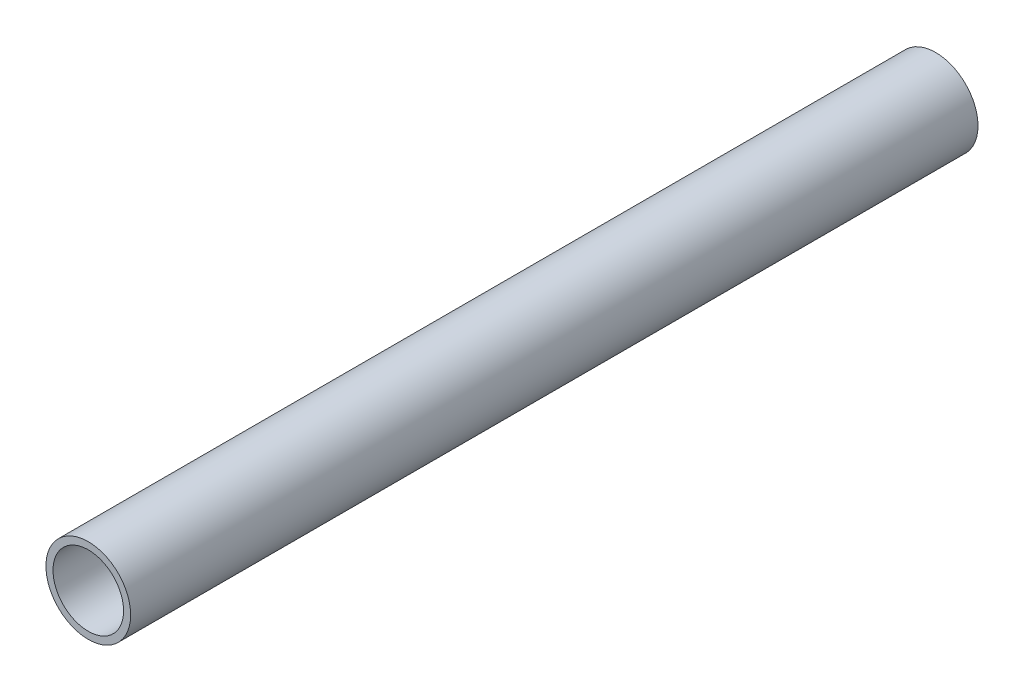
ISO-10303-21;
HEADER;
FILE_DESCRIPTION(('STEP AP214'),'2;1');
FILE_NAME('part.step','',(''),(''),'','','');
FILE_SCHEMA(('AUTOMOTIVE_DESIGN { 1 0 10303 214 1 1 1 1 }'));
ENDSEC;
DATA;
#1=APPLICATION_CONTEXT('core data for automotive mechanical design processes');
#2=APPLICATION_PROTOCOL_DEFINITION('international standard','automotive_design',2000,#1);
#3=PRODUCT_CONTEXT('',#1,'mechanical');
#4=PRODUCT('Part','Part','',(#3));
#5=PRODUCT_RELATED_PRODUCT_CATEGORY('part','',(#4));
#6=PRODUCT_DEFINITION_FORMATION('','',#4);
#7=PRODUCT_DEFINITION_CONTEXT('part definition',#1,'design');
#8=PRODUCT_DEFINITION('design','',#6,#7);
#9=PRODUCT_DEFINITION_SHAPE('','',#8);
#10=(LENGTH_UNIT() NAMED_UNIT(*) SI_UNIT(.MILLI.,.METRE.));
#11=(NAMED_UNIT(*) PLANE_ANGLE_UNIT() SI_UNIT($,.RADIAN.));
#12=(NAMED_UNIT(*) SI_UNIT($,.STERADIAN.) SOLID_ANGLE_UNIT());
#13=UNCERTAINTY_MEASURE_WITH_UNIT(LENGTH_MEASURE(1.E-05),#10,'distance_accuracy_value','');
#14=(GEOMETRIC_REPRESENTATION_CONTEXT(3) GLOBAL_UNCERTAINTY_ASSIGNED_CONTEXT((#13)) GLOBAL_UNIT_ASSIGNED_CONTEXT((#10,
#11,#12)) REPRESENTATION_CONTEXT('',''));
#15=CARTESIAN_POINT('',(0.,0.,0.));
#16=DIRECTION('',(0.,0.,1.));
#17=DIRECTION('',(1.,0.,0.));
#18=AXIS2_PLACEMENT_3D('',#15,#16,#17);
#19=CARTESIAN_POINT('',(0.,0.,60.));
#20=DIRECTION('',(0.,0.,1.));
#21=DIRECTION('',(1.,0.,0.));
#22=AXIS2_PLACEMENT_3D('',#19,#20,#21);
#23=PLANE('',#22);
#24=CARTESIAN_POINT('',(0.,0.,60.));
#25=DIRECTION('',(0.,0.,1.));
#26=DIRECTION('',(1.,0.,0.));
#27=AXIS2_PLACEMENT_3D('',#24,#25,#26);
#28=CIRCLE('',#27,3.);
#29=CARTESIAN_POINT('',(3.,0.,60.));
#30=VERTEX_POINT('',#29);
#31=EDGE_CURVE('E10',#30,#30,#28,.T.);
#32=ORIENTED_EDGE('',*,*,#31,.T.);
#33=EDGE_LOOP('',(#32));
#34=FACE_BOUND('',#33,.T.);
#35=CARTESIAN_POINT('',(0.,0.,60.));
#36=DIRECTION('',(0.,0.,1.));
#37=DIRECTION('',(1.,0.,0.));
#38=AXIS2_PLACEMENT_3D('',#35,#36,#37);
#39=CIRCLE('',#38,2.5);
#40=CARTESIAN_POINT('',(2.5,0.,60.));
#41=VERTEX_POINT('',#40);
#42=EDGE_CURVE('E39',#41,#41,#39,.T.);
#43=ORIENTED_EDGE('',*,*,#42,.F.);
#44=EDGE_LOOP('',(#43));
#45=FACE_BOUND('',#44,.T.);
#46=ADVANCED_FACE('F28',(#34,#45),#23,.T.);
#47=CARTESIAN_POINT('',(0.,0.,0.));
#48=DIRECTION('',(0.,0.,1.));
#49=DIRECTION('',(1.,0.,0.));
#50=AXIS2_PLACEMENT_3D('',#47,#48,#49);
#51=PLANE('',#50);
#52=CARTESIAN_POINT('',(0.,0.,0.));
#53=DIRECTION('',(0.,0.,1.));
#54=DIRECTION('',(1.,0.,0.));
#55=AXIS2_PLACEMENT_3D('',#52,#53,#54);
#56=CIRCLE('',#55,3.);
#57=CARTESIAN_POINT('',(3.,0.,0.));
#58=VERTEX_POINT('',#57);
#59=EDGE_CURVE('E32',#58,#58,#56,.T.);
#60=ORIENTED_EDGE('',*,*,#59,.F.);
#61=EDGE_LOOP('',(#60));
#62=FACE_BOUND('',#61,.T.);
#63=CARTESIAN_POINT('',(0.,0.,0.));
#64=DIRECTION('',(0.,0.,1.));
#65=DIRECTION('',(1.,0.,0.));
#66=AXIS2_PLACEMENT_3D('',#63,#64,#65);
#67=CIRCLE('',#66,2.5);
#68=CARTESIAN_POINT('',(2.5,0.,0.));
#69=VERTEX_POINT('',#68);
#70=EDGE_CURVE('E41',#69,#69,#67,.T.);
#71=ORIENTED_EDGE('',*,*,#70,.T.);
#72=EDGE_LOOP('',(#71));
#73=FACE_BOUND('',#72,.T.);
#74=ADVANCED_FACE('F51',(#62,#73),#51,.F.);
#75=CARTESIAN_POINT('',(0.,0.,60.));
#76=DIRECTION('',(0.,0.,-1.));
#77=DIRECTION('',(-1.,0.,0.));
#78=AXIS2_PLACEMENT_3D('',#75,#76,#77);
#79=CYLINDRICAL_SURFACE('',#78,3.);
#80=ORIENTED_EDGE('',*,*,#31,.F.);
#81=EDGE_LOOP('',(#80));
#82=FACE_BOUND('',#81,.T.);
#83=ORIENTED_EDGE('',*,*,#59,.T.);
#84=EDGE_LOOP('',(#83));
#85=FACE_BOUND('',#84,.T.);
#86=ADVANCED_FACE('F30',(#82,#85),#79,.T.);
#87=CARTESIAN_POINT('',(0.,0.,60.));
#88=DIRECTION('',(0.,0.,-1.));
#89=DIRECTION('',(-1.,0.,0.));
#90=AXIS2_PLACEMENT_3D('',#87,#88,#89);
#91=CYLINDRICAL_SURFACE('',#90,2.5);
#92=ORIENTED_EDGE('',*,*,#42,.T.);
#93=EDGE_LOOP('',(#92));
#94=FACE_BOUND('',#93,.T.);
#95=ORIENTED_EDGE('',*,*,#70,.F.);
#96=EDGE_LOOP('',(#95));
#97=FACE_BOUND('',#96,.T.);
#98=ADVANCED_FACE('F47',(#94,#97),#91,.F.);
#99=CLOSED_SHELL('',(#46,#74,#86,#98));
#100=MANIFOLD_SOLID_BREP('B2',#99);
#101=ADVANCED_BREP_SHAPE_REPRESENTATION('',(#18,#100),#14);
#102=SHAPE_DEFINITION_REPRESENTATION(#9,#101);
ENDSEC;
END-ISO-10303-21;
